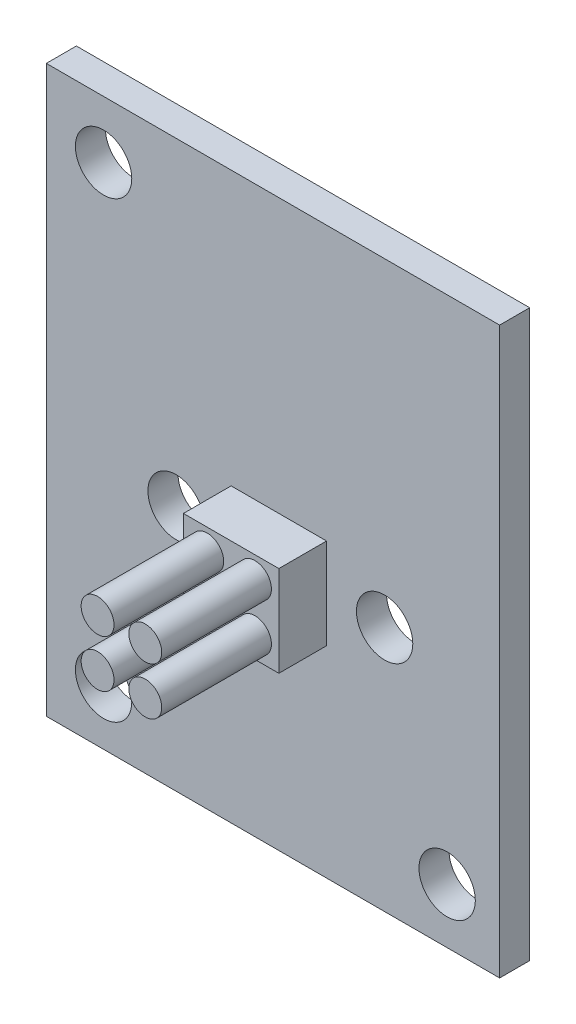
ISO-10303-21;
HEADER;
FILE_DESCRIPTION(('STEP AP214'),'2;1');
FILE_NAME('part.step','',(''),(''),'','','');
FILE_SCHEMA(('AUTOMOTIVE_DESIGN { 1 0 10303 214 1 1 1 1 }'));
ENDSEC;
DATA;
#1=APPLICATION_CONTEXT('core data for automotive mechanical design processes');
#2=APPLICATION_PROTOCOL_DEFINITION('international standard','automotive_design',2000,#1);
#3=PRODUCT_CONTEXT('',#1,'mechanical');
#4=PRODUCT('Part','Part','',(#3));
#5=PRODUCT_RELATED_PRODUCT_CATEGORY('part','',(#4));
#6=PRODUCT_DEFINITION_FORMATION('','',#4);
#7=PRODUCT_DEFINITION_CONTEXT('part definition',#1,'design');
#8=PRODUCT_DEFINITION('design','',#6,#7);
#9=PRODUCT_DEFINITION_SHAPE('','',#8);
#10=(LENGTH_UNIT() NAMED_UNIT(*) SI_UNIT(.MILLI.,.METRE.));
#11=(NAMED_UNIT(*) PLANE_ANGLE_UNIT() SI_UNIT($,.RADIAN.));
#12=(NAMED_UNIT(*) SI_UNIT($,.STERADIAN.) SOLID_ANGLE_UNIT());
#13=UNCERTAINTY_MEASURE_WITH_UNIT(LENGTH_MEASURE(1.E-05),#10,'distance_accuracy_value','');
#14=(GEOMETRIC_REPRESENTATION_CONTEXT(3) GLOBAL_UNCERTAINTY_ASSIGNED_CONTEXT((#13)) GLOBAL_UNIT_ASSIGNED_CONTEXT((#10,
#11,#12)) REPRESENTATION_CONTEXT('',''));
#15=CARTESIAN_POINT('',(0.,0.,0.));
#16=DIRECTION('',(0.,0.,1.));
#17=DIRECTION('',(1.,0.,0.));
#18=AXIS2_PLACEMENT_3D('',#15,#16,#17);
#19=CARTESIAN_POINT('',(0.,0.,2.54));
#20=DIRECTION('',(0.,0.,1.));
#21=DIRECTION('',(1.,0.,0.));
#22=AXIS2_PLACEMENT_3D('',#19,#20,#21);
#23=PLANE('',#22);
#24=CARTESIAN_POINT('',(11.107928,11.854942,2.54));
#25=DIRECTION('',(0.,0.,1.));
#26=DIRECTION('',(1.,0.,0.));
#27=AXIS2_PLACEMENT_3D('',#24,#25,#26);
#28=CIRCLE('',#27,0.875);
#29=CARTESIAN_POINT('',(11.982928,11.854942,2.54));
#30=VERTEX_POINT('',#29);
#31=EDGE_CURVE('E235',#30,#30,#28,.F.);
#32=ORIENTED_EDGE('',*,*,#31,.T.);
#33=EDGE_LOOP('',(#32));
#34=FACE_BOUND('',#33,.T.);
#35=CARTESIAN_POINT('',(13.647928,14.394942,2.54));
#36=DIRECTION('',(0.,0.,1.));
#37=DIRECTION('',(1.,0.,0.));
#38=AXIS2_PLACEMENT_3D('',#35,#36,#37);
#39=CIRCLE('',#38,0.875);
#40=CARTESIAN_POINT('',(14.522928,14.394942,2.54));
#41=VERTEX_POINT('',#40);
#42=EDGE_CURVE('E143',#41,#41,#39,.F.);
#43=ORIENTED_EDGE('',*,*,#42,.T.);
#44=EDGE_LOOP('',(#43));
#45=FACE_BOUND('',#44,.T.);
#46=DIRECTION('',(0.,1.,0.));
#47=VECTOR('',#46,1.);
#48=CARTESIAN_POINT('',(9.837928,0.,2.54));
#49=LINE('',#48,#47);
#50=CARTESIAN_POINT('',(9.837928,10.709942,2.54));
#51=VERTEX_POINT('',#50);
#52=CARTESIAN_POINT('',(9.837928,15.539942,2.54));
#53=VERTEX_POINT('',#52);
#54=EDGE_CURVE('E114',#51,#53,#49,.T.);
#55=ORIENTED_EDGE('',*,*,#54,.F.);
#56=DIRECTION('',(-1.,0.,0.));
#57=VECTOR('',#56,1.);
#58=CARTESIAN_POINT('',(0.,10.709942,2.54));
#59=LINE('',#58,#57);
#60=CARTESIAN_POINT('',(14.917928,10.709942,2.54));
#61=VERTEX_POINT('',#60);
#62=EDGE_CURVE('E127',#61,#51,#59,.T.);
#63=ORIENTED_EDGE('',*,*,#62,.F.);
#64=DIRECTION('',(0.,1.,0.));
#65=VECTOR('',#64,1.);
#66=CARTESIAN_POINT('',(14.917928,0.,2.54));
#67=LINE('',#66,#65);
#68=CARTESIAN_POINT('',(14.917928,15.539942,2.54));
#69=VERTEX_POINT('',#68);
#70=EDGE_CURVE('E134',#61,#69,#67,.T.);
#71=ORIENTED_EDGE('',*,*,#70,.T.);
#72=DIRECTION('',(-1.,0.,0.));
#73=VECTOR('',#72,1.);
#74=CARTESIAN_POINT('',(0.,15.539942,2.54));
#75=LINE('',#74,#73);
#76=EDGE_CURVE('E128',#69,#53,#75,.T.);
#77=ORIENTED_EDGE('',*,*,#76,.T.);
#78=EDGE_LOOP('',(#55,#63,#71,#77));
#79=FACE_BOUND('',#78,.T.);
#80=CARTESIAN_POINT('',(11.107928,14.394942,2.54));
#81=DIRECTION('',(0.,0.,1.));
#82=DIRECTION('',(1.,0.,0.));
#83=AXIS2_PLACEMENT_3D('',#80,#81,#82);
#84=CIRCLE('',#83,0.875);
#85=CARTESIAN_POINT('',(11.982928,14.394942,2.54));
#86=VERTEX_POINT('',#85);
#87=EDGE_CURVE('E232',#86,#86,#84,.F.);
#88=ORIENTED_EDGE('',*,*,#87,.T.);
#89=EDGE_LOOP('',(#88));
#90=FACE_BOUND('',#89,.T.);
#91=CARTESIAN_POINT('',(13.647928,11.854942,2.54));
#92=DIRECTION('',(0.,0.,1.));
#93=DIRECTION('',(1.,0.,0.));
#94=AXIS2_PLACEMENT_3D('',#91,#92,#93);
#95=CIRCLE('',#94,0.875);
#96=CARTESIAN_POINT('',(14.522928,11.854942,2.54));
#97=VERTEX_POINT('',#96);
#98=EDGE_CURVE('E39',#97,#97,#95,.F.);
#99=ORIENTED_EDGE('',*,*,#98,.T.);
#100=EDGE_LOOP('',(#99));
#101=FACE_BOUND('',#100,.T.);
#102=ADVANCED_FACE('F35',(#34,#45,#79,#90,#101),#23,.T.);
#103=CARTESIAN_POINT('',(0.,0.,-1.6));
#104=DIRECTION('',(0.,-1.,0.));
#105=DIRECTION('',(0.,0.,-1.));
#106=AXIS2_PLACEMENT_3D('',#103,#104,#105);
#107=PLANE('',#106);
#108=DIRECTION('',(1.,0.,0.));
#109=VECTOR('',#108,1.);
#110=CARTESIAN_POINT('',(0.,0.,0.));
#111=LINE('',#110,#109);
#112=CARTESIAN_POINT('',(0.,0.,0.));
#113=VERTEX_POINT('',#112);
#114=CARTESIAN_POINT('',(24.13,0.,0.));
#115=VERTEX_POINT('',#114);
#116=EDGE_CURVE('E214',#113,#115,#111,.T.);
#117=ORIENTED_EDGE('',*,*,#116,.F.);
#118=DIRECTION('',(0.,0.,1.));
#119=VECTOR('',#118,1.);
#120=CARTESIAN_POINT('',(0.,0.,-1.6));
#121=LINE('',#120,#119);
#122=CARTESIAN_POINT('',(0.,0.,-1.6));
#123=VERTEX_POINT('',#122);
#124=EDGE_CURVE('E11',#123,#113,#121,.T.);
#125=ORIENTED_EDGE('',*,*,#124,.F.);
#126=DIRECTION('',(1.,0.,0.));
#127=VECTOR('',#126,1.);
#128=CARTESIAN_POINT('',(0.,0.,-1.6));
#129=LINE('',#128,#127);
#130=CARTESIAN_POINT('',(24.13,0.,-1.6));
#131=VERTEX_POINT('',#130);
#132=EDGE_CURVE('E191',#123,#131,#129,.T.);
#133=ORIENTED_EDGE('',*,*,#132,.T.);
#134=DIRECTION('',(0.,0.,1.));
#135=VECTOR('',#134,1.);
#136=CARTESIAN_POINT('',(24.13,0.,-1.6));
#137=LINE('',#136,#135);
#138=EDGE_CURVE('E85',#131,#115,#137,.T.);
#139=ORIENTED_EDGE('',*,*,#138,.T.);
#140=EDGE_LOOP('',(#117,#125,#133,#139));
#141=FACE_BOUND('',#140,.T.);
#142=ADVANCED_FACE('F272',(#141),#107,.T.);
#143=CARTESIAN_POINT('',(0.,0.,-1.6));
#144=DIRECTION('',(1.,0.,0.));
#145=DIRECTION('',(0.,0.,-1.));
#146=AXIS2_PLACEMENT_3D('',#143,#144,#145);
#147=PLANE('',#146);
#148=DIRECTION('',(0.,1.,0.));
#149=VECTOR('',#148,1.);
#150=CARTESIAN_POINT('',(0.,0.,0.));
#151=LINE('',#150,#149);
#152=CARTESIAN_POINT('',(0.,30.099,0.));
#153=VERTEX_POINT('',#152);
#154=EDGE_CURVE('E167',#113,#153,#151,.T.);
#155=ORIENTED_EDGE('',*,*,#154,.T.);
#156=DIRECTION('',(0.,0.,1.));
#157=VECTOR('',#156,1.);
#158=CARTESIAN_POINT('',(0.,30.099,-1.6));
#159=LINE('',#158,#157);
#160=CARTESIAN_POINT('',(0.,30.099,-1.6));
#161=VERTEX_POINT('',#160);
#162=EDGE_CURVE('E44',#161,#153,#159,.T.);
#163=ORIENTED_EDGE('',*,*,#162,.F.);
#164=DIRECTION('',(0.,1.,0.));
#165=VECTOR('',#164,1.);
#166=CARTESIAN_POINT('',(0.,0.,-1.6));
#167=LINE('',#166,#165);
#168=EDGE_CURVE('E197',#123,#161,#167,.T.);
#169=ORIENTED_EDGE('',*,*,#168,.F.);
#170=ORIENTED_EDGE('',*,*,#124,.T.);
#171=EDGE_LOOP('',(#155,#163,#169,#170));
#172=FACE_BOUND('',#171,.T.);
#173=ADVANCED_FACE('F276',(#172),#147,.F.);
#174=CARTESIAN_POINT('',(0.,30.099,-1.6));
#175=DIRECTION('',(0.,-1.,0.));
#176=DIRECTION('',(0.,0.,-1.));
#177=AXIS2_PLACEMENT_3D('',#174,#175,#176);
#178=PLANE('',#177);
#179=DIRECTION('',(1.,0.,0.));
#180=VECTOR('',#179,1.);
#181=CARTESIAN_POINT('',(0.,30.099,0.));
#182=LINE('',#181,#180);
#183=CARTESIAN_POINT('',(24.13,30.099,0.));
#184=VERTEX_POINT('',#183);
#185=EDGE_CURVE('E220',#153,#184,#182,.T.);
#186=ORIENTED_EDGE('',*,*,#185,.T.);
#187=DIRECTION('',(0.,0.,1.));
#188=VECTOR('',#187,1.);
#189=CARTESIAN_POINT('',(24.13,30.099,-1.6));
#190=LINE('',#189,#188);
#191=CARTESIAN_POINT('',(24.13,30.099,-1.6));
#192=VERTEX_POINT('',#191);
#193=EDGE_CURVE('E226',#192,#184,#190,.T.);
#194=ORIENTED_EDGE('',*,*,#193,.F.);
#195=DIRECTION('',(1.,0.,0.));
#196=VECTOR('',#195,1.);
#197=CARTESIAN_POINT('',(0.,30.099,-1.6));
#198=LINE('',#197,#196);
#199=EDGE_CURVE('E195',#161,#192,#198,.T.);
#200=ORIENTED_EDGE('',*,*,#199,.F.);
#201=ORIENTED_EDGE('',*,*,#162,.T.);
#202=EDGE_LOOP('',(#186,#194,#200,#201));
#203=FACE_BOUND('',#202,.T.);
#204=ADVANCED_FACE('F302',(#203),#178,.F.);
#205=CARTESIAN_POINT('',(3.048,2.921,-1.6));
#206=DIRECTION('',(0.,0.,1.));
#207=DIRECTION('',(1.,0.,0.));
#208=AXIS2_PLACEMENT_3D('',#205,#206,#207);
#209=CYLINDRICAL_SURFACE('',#208,1.5);
#210=CARTESIAN_POINT('',(3.048,2.921,-1.6));
#211=DIRECTION('',(0.,0.,1.));
#212=DIRECTION('',(1.,0.,0.));
#213=AXIS2_PLACEMENT_3D('',#210,#211,#212);
#214=CIRCLE('',#213,1.5);
#215=CARTESIAN_POINT('',(4.548,2.921,-1.6));
#216=VERTEX_POINT('',#215);
#217=EDGE_CURVE('E188',#216,#216,#214,.T.);
#218=ORIENTED_EDGE('',*,*,#217,.F.);
#219=EDGE_LOOP('',(#218));
#220=FACE_BOUND('',#219,.T.);
#221=CARTESIAN_POINT('',(3.048,2.921,0.));
#222=DIRECTION('',(0.,0.,1.));
#223=DIRECTION('',(1.,0.,0.));
#224=AXIS2_PLACEMENT_3D('',#221,#222,#223);
#225=CIRCLE('',#224,1.5);
#226=CARTESIAN_POINT('',(4.548,2.921,0.));
#227=VERTEX_POINT('',#226);
#228=EDGE_CURVE('E211',#227,#227,#225,.T.);
#229=ORIENTED_EDGE('',*,*,#228,.T.);
#230=EDGE_LOOP('',(#229));
#231=FACE_BOUND('',#230,.T.);
#232=ADVANCED_FACE('F305',(#220,#231),#209,.F.);
#233=CARTESIAN_POINT('',(21.336,2.921,-1.6));
#234=DIRECTION('',(0.,0.,1.));
#235=DIRECTION('',(1.,0.,0.));
#236=AXIS2_PLACEMENT_3D('',#233,#234,#235);
#237=CYLINDRICAL_SURFACE('',#236,1.5);
#238=CARTESIAN_POINT('',(21.336,2.921,-1.6));
#239=DIRECTION('',(0.,0.,1.));
#240=DIRECTION('',(1.,0.,0.));
#241=AXIS2_PLACEMENT_3D('',#238,#239,#240);
#242=CIRCLE('',#241,1.5);
#243=CARTESIAN_POINT('',(22.836,2.921,-1.6));
#244=VERTEX_POINT('',#243);
#245=EDGE_CURVE('E185',#244,#244,#242,.T.);
#246=ORIENTED_EDGE('',*,*,#245,.F.);
#247=EDGE_LOOP('',(#246));
#248=FACE_BOUND('',#247,.T.);
#249=CARTESIAN_POINT('',(21.336,2.921,0.));
#250=DIRECTION('',(0.,0.,1.));
#251=DIRECTION('',(1.,0.,0.));
#252=AXIS2_PLACEMENT_3D('',#249,#250,#251);
#253=CIRCLE('',#252,1.5);
#254=CARTESIAN_POINT('',(22.836,2.921,0.));
#255=VERTEX_POINT('',#254);
#256=EDGE_CURVE('E208',#255,#255,#253,.T.);
#257=ORIENTED_EDGE('',*,*,#256,.T.);
#258=EDGE_LOOP('',(#257));
#259=FACE_BOUND('',#258,.T.);
#260=ADVANCED_FACE('F311',(#248,#259),#237,.F.);
#261=CARTESIAN_POINT('',(3.048,27.051,-1.6));
#262=DIRECTION('',(0.,0.,1.));
#263=DIRECTION('',(1.,0.,0.));
#264=AXIS2_PLACEMENT_3D('',#261,#262,#263);
#265=CYLINDRICAL_SURFACE('',#264,1.5);
#266=CARTESIAN_POINT('',(3.048,27.051,-1.6));
#267=DIRECTION('',(0.,0.,1.));
#268=DIRECTION('',(1.,0.,0.));
#269=AXIS2_PLACEMENT_3D('',#266,#267,#268);
#270=CIRCLE('',#269,1.5);
#271=CARTESIAN_POINT('',(4.548,27.051,-1.6));
#272=VERTEX_POINT('',#271);
#273=EDGE_CURVE('E182',#272,#272,#270,.T.);
#274=ORIENTED_EDGE('',*,*,#273,.F.);
#275=EDGE_LOOP('',(#274));
#276=FACE_BOUND('',#275,.T.);
#277=CARTESIAN_POINT('',(3.048,27.051,0.));
#278=DIRECTION('',(0.,0.,1.));
#279=DIRECTION('',(1.,0.,0.));
#280=AXIS2_PLACEMENT_3D('',#277,#278,#279);
#281=CIRCLE('',#280,1.5);
#282=CARTESIAN_POINT('',(4.548,27.051,0.));
#283=VERTEX_POINT('',#282);
#284=EDGE_CURVE('E205',#283,#283,#281,.T.);
#285=ORIENTED_EDGE('',*,*,#284,.T.);
#286=EDGE_LOOP('',(#285));
#287=FACE_BOUND('',#286,.T.);
#288=ADVANCED_FACE('F315',(#276,#287),#265,.F.);
#289=CARTESIAN_POINT('',(6.908038,13.09497,-1.6));
#290=DIRECTION('',(0.,0.,1.));
#291=DIRECTION('',(1.,0.,0.));
#292=AXIS2_PLACEMENT_3D('',#289,#290,#291);
#293=CYLINDRICAL_SURFACE('',#292,1.5);
#294=CARTESIAN_POINT('',(6.908038,13.09497,-1.6));
#295=DIRECTION('',(0.,0.,1.));
#296=DIRECTION('',(1.,0.,0.));
#297=AXIS2_PLACEMENT_3D('',#294,#295,#296);
#298=CIRCLE('',#297,1.5);
#299=CARTESIAN_POINT('',(8.408038,13.09497,-1.6));
#300=VERTEX_POINT('',#299);
#301=EDGE_CURVE('E179',#300,#300,#298,.T.);
#302=ORIENTED_EDGE('',*,*,#301,.F.);
#303=EDGE_LOOP('',(#302));
#304=FACE_BOUND('',#303,.T.);
#305=CARTESIAN_POINT('',(6.908038,13.09497,0.));
#306=DIRECTION('',(0.,0.,1.));
#307=DIRECTION('',(1.,0.,0.));
#308=AXIS2_PLACEMENT_3D('',#305,#306,#307);
#309=CIRCLE('',#308,1.5);
#310=CARTESIAN_POINT('',(8.408038,13.09497,0.));
#311=VERTEX_POINT('',#310);
#312=EDGE_CURVE('E202',#311,#311,#309,.T.);
#313=ORIENTED_EDGE('',*,*,#312,.T.);
#314=EDGE_LOOP('',(#313));
#315=FACE_BOUND('',#314,.T.);
#316=ADVANCED_FACE('F319',(#304,#315),#293,.F.);
#317=CARTESIAN_POINT('',(18.008092,13.09497,-1.6));
#318=DIRECTION('',(0.,0.,1.));
#319=DIRECTION('',(1.,0.,0.));
#320=AXIS2_PLACEMENT_3D('',#317,#318,#319);
#321=CYLINDRICAL_SURFACE('',#320,1.5);
#322=CARTESIAN_POINT('',(18.008092,13.09497,-1.6));
#323=DIRECTION('',(0.,0.,1.));
#324=DIRECTION('',(1.,0.,0.));
#325=AXIS2_PLACEMENT_3D('',#322,#323,#324);
#326=CIRCLE('',#325,1.5);
#327=CARTESIAN_POINT('',(19.508092,13.09497,-1.6));
#328=VERTEX_POINT('',#327);
#329=EDGE_CURVE('E176',#328,#328,#326,.T.);
#330=ORIENTED_EDGE('',*,*,#329,.F.);
#331=EDGE_LOOP('',(#330));
#332=FACE_BOUND('',#331,.T.);
#333=CARTESIAN_POINT('',(18.008092,13.09497,0.));
#334=DIRECTION('',(0.,0.,1.));
#335=DIRECTION('',(1.,0.,0.));
#336=AXIS2_PLACEMENT_3D('',#333,#334,#335);
#337=CIRCLE('',#336,1.5);
#338=CARTESIAN_POINT('',(19.508092,13.09497,0.));
#339=VERTEX_POINT('',#338);
#340=EDGE_CURVE('E162',#339,#339,#337,.T.);
#341=ORIENTED_EDGE('',*,*,#340,.T.);
#342=EDGE_LOOP('',(#341));
#343=FACE_BOUND('',#342,.T.);
#344=ADVANCED_FACE('F323',(#332,#343),#321,.F.);
#345=CARTESIAN_POINT('',(11.107928,14.394942,-1.6));
#346=DIRECTION('',(0.,0.,1.));
#347=DIRECTION('',(1.,0.,0.));
#348=AXIS2_PLACEMENT_3D('',#345,#346,#347);
#349=CYLINDRICAL_SURFACE('',#348,0.875);
#350=CARTESIAN_POINT('',(11.107928,14.394942,-1.6));
#351=DIRECTION('',(0.,0.,1.));
#352=DIRECTION('',(1.,0.,0.));
#353=AXIS2_PLACEMENT_3D('',#350,#351,#352);
#354=CIRCLE('',#353,0.875);
#355=CARTESIAN_POINT('',(11.982928,14.394942,-1.6));
#356=VERTEX_POINT('',#355);
#357=EDGE_CURVE('E173',#356,#356,#354,.T.);
#358=ORIENTED_EDGE('',*,*,#357,.F.);
#359=EDGE_LOOP('',(#358));
#360=FACE_BOUND('',#359,.T.);
#361=CARTESIAN_POINT('',(11.107928,14.394942,0.));
#362=DIRECTION('',(0.,0.,1.));
#363=DIRECTION('',(1.,0.,0.));
#364=AXIS2_PLACEMENT_3D('',#361,#362,#363);
#365=CIRCLE('',#364,0.875);
#366=CARTESIAN_POINT('',(11.982928,14.394942,0.));
#367=VERTEX_POINT('',#366);
#368=EDGE_CURVE('E159',#367,#367,#365,.F.);
#369=ORIENTED_EDGE('',*,*,#368,.F.);
#370=EDGE_LOOP('',(#369));
#371=FACE_BOUND('',#370,.T.);
#372=ADVANCED_FACE('F327',(#360,#371),#349,.F.);
#373=CARTESIAN_POINT('',(13.647928,14.394942,-1.6));
#374=DIRECTION('',(0.,0.,1.));
#375=DIRECTION('',(1.,0.,0.));
#376=AXIS2_PLACEMENT_3D('',#373,#374,#375);
#377=CYLINDRICAL_SURFACE('',#376,0.875);
#378=CARTESIAN_POINT('',(13.647928,14.394942,-1.6));
#379=DIRECTION('',(0.,0.,1.));
#380=DIRECTION('',(1.,0.,0.));
#381=AXIS2_PLACEMENT_3D('',#378,#379,#380);
#382=CIRCLE('',#381,0.875);
#383=CARTESIAN_POINT('',(14.522928,14.394942,-1.6));
#384=VERTEX_POINT('',#383);
#385=EDGE_CURVE('E170',#384,#384,#382,.T.);
#386=ORIENTED_EDGE('',*,*,#385,.F.);
#387=EDGE_LOOP('',(#386));
#388=FACE_BOUND('',#387,.T.);
#389=CARTESIAN_POINT('',(13.647928,14.394942,0.));
#390=DIRECTION('',(0.,0.,1.));
#391=DIRECTION('',(1.,0.,0.));
#392=AXIS2_PLACEMENT_3D('',#389,#390,#391);
#393=CIRCLE('',#392,0.875);
#394=CARTESIAN_POINT('',(14.522928,14.394942,0.));
#395=VERTEX_POINT('',#394);
#396=EDGE_CURVE('E156',#395,#395,#393,.F.);
#397=ORIENTED_EDGE('',*,*,#396,.F.);
#398=EDGE_LOOP('',(#397));
#399=FACE_BOUND('',#398,.T.);
#400=ADVANCED_FACE('F331',(#388,#399),#377,.F.);
#401=CARTESIAN_POINT('',(11.107928,11.854942,-1.6));
#402=DIRECTION('',(0.,0.,1.));
#403=DIRECTION('',(1.,0.,0.));
#404=AXIS2_PLACEMENT_3D('',#401,#402,#403);
#405=CYLINDRICAL_SURFACE('',#404,0.875);
#406=CARTESIAN_POINT('',(11.107928,11.854942,-1.6));
#407=DIRECTION('',(0.,0.,1.));
#408=DIRECTION('',(1.,0.,0.));
#409=AXIS2_PLACEMENT_3D('',#406,#407,#408);
#410=CIRCLE('',#409,0.875);
#411=CARTESIAN_POINT('',(11.982928,11.854942,-1.6));
#412=VERTEX_POINT('',#411);
#413=EDGE_CURVE('E166',#412,#412,#410,.T.);
#414=ORIENTED_EDGE('',*,*,#413,.F.);
#415=EDGE_LOOP('',(#414));
#416=FACE_BOUND('',#415,.T.);
#417=CARTESIAN_POINT('',(11.107928,11.854942,0.));
#418=DIRECTION('',(0.,0.,1.));
#419=DIRECTION('',(1.,0.,0.));
#420=AXIS2_PLACEMENT_3D('',#417,#418,#419);
#421=CIRCLE('',#420,0.875);
#422=CARTESIAN_POINT('',(11.982928,11.854942,0.));
#423=VERTEX_POINT('',#422);
#424=EDGE_CURVE('E153',#423,#423,#421,.F.);
#425=ORIENTED_EDGE('',*,*,#424,.F.);
#426=EDGE_LOOP('',(#425));
#427=FACE_BOUND('',#426,.T.);
#428=ADVANCED_FACE('F334',(#416,#427),#405,.F.);
#429=CARTESIAN_POINT('',(13.647928,11.854942,-1.6));
#430=DIRECTION('',(0.,0.,1.));
#431=DIRECTION('',(1.,0.,0.));
#432=AXIS2_PLACEMENT_3D('',#429,#430,#431);
#433=CYLINDRICAL_SURFACE('',#432,0.875);
#434=CARTESIAN_POINT('',(13.647928,11.854942,-1.6));
#435=DIRECTION('',(0.,0.,1.));
#436=DIRECTION('',(1.,0.,0.));
#437=AXIS2_PLACEMENT_3D('',#434,#435,#436);
#438=CIRCLE('',#437,0.875);
#439=CARTESIAN_POINT('',(14.522928,11.854942,-1.6));
#440=VERTEX_POINT('',#439);
#441=EDGE_CURVE('E163',#440,#440,#438,.T.);
#442=ORIENTED_EDGE('',*,*,#441,.F.);
#443=EDGE_LOOP('',(#442));
#444=FACE_BOUND('',#443,.T.);
#445=CARTESIAN_POINT('',(13.647928,11.854942,0.));
#446=DIRECTION('',(0.,0.,1.));
#447=DIRECTION('',(1.,0.,0.));
#448=AXIS2_PLACEMENT_3D('',#445,#446,#447);
#449=CIRCLE('',#448,0.875);
#450=CARTESIAN_POINT('',(14.522928,11.854942,0.));
#451=VERTEX_POINT('',#450);
#452=EDGE_CURVE('E121',#451,#451,#449,.F.);
#453=ORIENTED_EDGE('',*,*,#452,.F.);
#454=EDGE_LOOP('',(#453));
#455=FACE_BOUND('',#454,.T.);
#456=ADVANCED_FACE('F37',(#444,#455),#433,.F.);
#457=CARTESIAN_POINT('',(24.13,0.,-1.6));
#458=DIRECTION('',(1.,0.,0.));
#459=DIRECTION('',(0.,0.,-1.));
#460=AXIS2_PLACEMENT_3D('',#457,#458,#459);
#461=PLANE('',#460);
#462=DIRECTION('',(0.,1.,0.));
#463=VECTOR('',#462,1.);
#464=CARTESIAN_POINT('',(24.13,0.,0.));
#465=LINE('',#464,#463);
#466=EDGE_CURVE('E217',#115,#184,#465,.T.);
#467=ORIENTED_EDGE('',*,*,#466,.F.);
#468=ORIENTED_EDGE('',*,*,#138,.F.);
#469=DIRECTION('',(0.,1.,0.));
#470=VECTOR('',#469,1.);
#471=CARTESIAN_POINT('',(24.13,0.,-1.6));
#472=LINE('',#471,#470);
#473=EDGE_CURVE('E193',#131,#192,#472,.T.);
#474=ORIENTED_EDGE('',*,*,#473,.T.);
#475=ORIENTED_EDGE('',*,*,#193,.T.);
#476=EDGE_LOOP('',(#467,#468,#474,#475));
#477=FACE_BOUND('',#476,.T.);
#478=ADVANCED_FACE('F295',(#477),#461,.T.);
#479=CARTESIAN_POINT('',(0.,0.,-1.6));
#480=DIRECTION('',(0.,0.,1.));
#481=DIRECTION('',(1.,0.,0.));
#482=AXIS2_PLACEMENT_3D('',#479,#480,#481);
#483=PLANE('',#482);
#484=ORIENTED_EDGE('',*,*,#441,.T.);
#485=EDGE_LOOP('',(#484));
#486=FACE_BOUND('',#485,.T.);
#487=ORIENTED_EDGE('',*,*,#413,.T.);
#488=EDGE_LOOP('',(#487));
#489=FACE_BOUND('',#488,.T.);
#490=ORIENTED_EDGE('',*,*,#385,.T.);
#491=EDGE_LOOP('',(#490));
#492=FACE_BOUND('',#491,.T.);
#493=ORIENTED_EDGE('',*,*,#357,.T.);
#494=EDGE_LOOP('',(#493));
#495=FACE_BOUND('',#494,.T.);
#496=ORIENTED_EDGE('',*,*,#329,.T.);
#497=EDGE_LOOP('',(#496));
#498=FACE_BOUND('',#497,.T.);
#499=ORIENTED_EDGE('',*,*,#301,.T.);
#500=EDGE_LOOP('',(#499));
#501=FACE_BOUND('',#500,.T.);
#502=ORIENTED_EDGE('',*,*,#273,.T.);
#503=EDGE_LOOP('',(#502));
#504=FACE_BOUND('',#503,.T.);
#505=ORIENTED_EDGE('',*,*,#245,.T.);
#506=EDGE_LOOP('',(#505));
#507=FACE_BOUND('',#506,.T.);
#508=ORIENTED_EDGE('',*,*,#217,.T.);
#509=EDGE_LOOP('',(#508));
#510=FACE_BOUND('',#509,.T.);
#511=ORIENTED_EDGE('',*,*,#132,.F.);
#512=ORIENTED_EDGE('',*,*,#168,.T.);
#513=ORIENTED_EDGE('',*,*,#199,.T.);
#514=ORIENTED_EDGE('',*,*,#473,.F.);
#515=EDGE_LOOP('',(#511,#512,#513,#514));
#516=FACE_BOUND('',#515,.T.);
#517=ADVANCED_FACE('F292',(#486,#489,#492,#495,#498,#501,#504,#507,#510,#516),#483,.F.);
#518=CARTESIAN_POINT('',(0.,0.,0.));
#519=DIRECTION('',(0.,0.,1.));
#520=DIRECTION('',(1.,0.,0.));
#521=AXIS2_PLACEMENT_3D('',#518,#519,#520);
#522=PLANE('',#521);
#523=DIRECTION('',(0.,1.,0.));
#524=VECTOR('',#523,1.);
#525=CARTESIAN_POINT('',(9.837928,0.,0.));
#526=LINE('',#525,#524);
#527=CARTESIAN_POINT('',(9.837928,10.709942,0.));
#528=VERTEX_POINT('',#527);
#529=CARTESIAN_POINT('',(9.837928,15.539942,0.));
#530=VERTEX_POINT('',#529);
#531=EDGE_CURVE('E116',#528,#530,#526,.T.);
#532=ORIENTED_EDGE('',*,*,#531,.T.);
#533=DIRECTION('',(-1.,0.,0.));
#534=VECTOR('',#533,1.);
#535=CARTESIAN_POINT('',(0.,15.539942,0.));
#536=LINE('',#535,#534);
#537=CARTESIAN_POINT('',(14.917928,15.539942,0.));
#538=VERTEX_POINT('',#537);
#539=EDGE_CURVE('E130',#538,#530,#536,.T.);
#540=ORIENTED_EDGE('',*,*,#539,.F.);
#541=DIRECTION('',(0.,1.,0.));
#542=VECTOR('',#541,1.);
#543=CARTESIAN_POINT('',(14.917928,0.,0.));
#544=LINE('',#543,#542);
#545=CARTESIAN_POINT('',(14.917928,10.709942,0.));
#546=VERTEX_POINT('',#545);
#547=EDGE_CURVE('E145',#546,#538,#544,.T.);
#548=ORIENTED_EDGE('',*,*,#547,.F.);
#549=DIRECTION('',(-1.,0.,0.));
#550=VECTOR('',#549,1.);
#551=CARTESIAN_POINT('',(0.,10.709942,0.));
#552=LINE('',#551,#550);
#553=EDGE_CURVE('E142',#546,#528,#552,.T.);
#554=ORIENTED_EDGE('',*,*,#553,.T.);
#555=EDGE_LOOP('',(#532,#540,#548,#554));
#556=FACE_BOUND('',#555,.T.);
#557=ORIENTED_EDGE('',*,*,#340,.F.);
#558=EDGE_LOOP('',(#557));
#559=FACE_BOUND('',#558,.T.);
#560=ORIENTED_EDGE('',*,*,#312,.F.);
#561=EDGE_LOOP('',(#560));
#562=FACE_BOUND('',#561,.T.);
#563=ORIENTED_EDGE('',*,*,#284,.F.);
#564=EDGE_LOOP('',(#563));
#565=FACE_BOUND('',#564,.T.);
#566=ORIENTED_EDGE('',*,*,#256,.F.);
#567=EDGE_LOOP('',(#566));
#568=FACE_BOUND('',#567,.T.);
#569=ORIENTED_EDGE('',*,*,#228,.F.);
#570=EDGE_LOOP('',(#569));
#571=FACE_BOUND('',#570,.T.);
#572=ORIENTED_EDGE('',*,*,#116,.T.);
#573=ORIENTED_EDGE('',*,*,#466,.T.);
#574=ORIENTED_EDGE('',*,*,#185,.F.);
#575=ORIENTED_EDGE('',*,*,#154,.F.);
#576=EDGE_LOOP('',(#572,#573,#574,#575));
#577=FACE_BOUND('',#576,.T.);
#578=ADVANCED_FACE('F284',(#556,#559,#562,#565,#568,#571,#577),#522,.T.);
#579=CARTESIAN_POINT('',(0.,15.539942,2.54));
#580=DIRECTION('',(0.,-1.,0.));
#581=DIRECTION('',(1.,0.,0.));
#582=AXIS2_PLACEMENT_3D('',#579,#580,#581);
#583=PLANE('',#582);
#584=ORIENTED_EDGE('',*,*,#539,.T.);
#585=DIRECTION('',(0.,0.,-1.));
#586=VECTOR('',#585,1.);
#587=CARTESIAN_POINT('',(9.837928,15.539942,2.54));
#588=LINE('',#587,#586);
#589=EDGE_CURVE('E140',#53,#530,#588,.T.);
#590=ORIENTED_EDGE('',*,*,#589,.F.);
#591=ORIENTED_EDGE('',*,*,#76,.F.);
#592=DIRECTION('',(0.,0.,-1.));
#593=VECTOR('',#592,1.);
#594=CARTESIAN_POINT('',(14.917928,15.539942,2.54));
#595=LINE('',#594,#593);
#596=EDGE_CURVE('E52',#69,#538,#595,.T.);
#597=ORIENTED_EDGE('',*,*,#596,.T.);
#598=EDGE_LOOP('',(#584,#590,#591,#597));
#599=FACE_BOUND('',#598,.T.);
#600=ADVANCED_FACE('F280',(#599),#583,.F.);
#601=CARTESIAN_POINT('',(14.917928,0.,2.54));
#602=DIRECTION('',(-1.,0.,0.));
#603=DIRECTION('',(0.,-1.,0.));
#604=AXIS2_PLACEMENT_3D('',#601,#602,#603);
#605=PLANE('',#604);
#606=ORIENTED_EDGE('',*,*,#547,.T.);
#607=ORIENTED_EDGE('',*,*,#596,.F.);
#608=ORIENTED_EDGE('',*,*,#70,.F.);
#609=DIRECTION('',(0.,0.,-1.));
#610=VECTOR('',#609,1.);
#611=CARTESIAN_POINT('',(14.917928,10.709942,2.54));
#612=LINE('',#611,#610);
#613=EDGE_CURVE('E122',#61,#546,#612,.T.);
#614=ORIENTED_EDGE('',*,*,#613,.T.);
#615=EDGE_LOOP('',(#606,#607,#608,#614));
#616=FACE_BOUND('',#615,.T.);
#617=ADVANCED_FACE('F283',(#616),#605,.F.);
#618=CARTESIAN_POINT('',(0.,10.709942,2.54));
#619=DIRECTION('',(0.,-1.,0.));
#620=DIRECTION('',(1.,0.,0.));
#621=AXIS2_PLACEMENT_3D('',#618,#619,#620);
#622=PLANE('',#621);
#623=ORIENTED_EDGE('',*,*,#553,.F.);
#624=ORIENTED_EDGE('',*,*,#613,.F.);
#625=ORIENTED_EDGE('',*,*,#62,.T.);
#626=DIRECTION('',(0.,0.,-1.));
#627=VECTOR('',#626,1.);
#628=CARTESIAN_POINT('',(9.837928,10.709942,2.54));
#629=LINE('',#628,#627);
#630=EDGE_CURVE('E111',#51,#528,#629,.T.);
#631=ORIENTED_EDGE('',*,*,#630,.T.);
#632=EDGE_LOOP('',(#623,#624,#625,#631));
#633=FACE_BOUND('',#632,.T.);
#634=ADVANCED_FACE('F132',(#633),#622,.T.);
#635=CARTESIAN_POINT('',(9.837928,0.,2.54));
#636=DIRECTION('',(-1.,0.,0.));
#637=DIRECTION('',(0.,-1.,0.));
#638=AXIS2_PLACEMENT_3D('',#635,#636,#637);
#639=PLANE('',#638);
#640=ORIENTED_EDGE('',*,*,#531,.F.);
#641=ORIENTED_EDGE('',*,*,#630,.F.);
#642=ORIENTED_EDGE('',*,*,#54,.T.);
#643=ORIENTED_EDGE('',*,*,#589,.T.);
#644=EDGE_LOOP('',(#640,#641,#642,#643));
#645=FACE_BOUND('',#644,.T.);
#646=ADVANCED_FACE('F113',(#645),#639,.T.);
#647=CARTESIAN_POINT('',(0.,0.,0.));
#648=DIRECTION('',(0.,0.,1.));
#649=DIRECTION('',(1.,0.,0.));
#650=AXIS2_PLACEMENT_3D('',#647,#648,#649);
#651=PLANE('',#650);
#652=ORIENTED_EDGE('',*,*,#452,.T.);
#653=EDGE_LOOP('',(#652));
#654=FACE_BOUND('',#653,.T.);
#655=ADVANCED_FACE('F268',(#654),#651,.F.);
#656=ORIENTED_EDGE('',*,*,#424,.T.);
#657=EDGE_LOOP('',(#656));
#658=FACE_BOUND('',#657,.T.);
#659=ADVANCED_FACE('F346',(#658),#651,.F.);
#660=ORIENTED_EDGE('',*,*,#396,.T.);
#661=EDGE_LOOP('',(#660));
#662=FACE_BOUND('',#661,.T.);
#663=ADVANCED_FACE('F265',(#662),#651,.F.);
#664=ORIENTED_EDGE('',*,*,#368,.T.);
#665=EDGE_LOOP('',(#664));
#666=FACE_BOUND('',#665,.T.);
#667=ADVANCED_FACE('F256',(#666),#651,.F.);
#668=CARTESIAN_POINT('',(13.647928,14.394942,8.38));
#669=DIRECTION('',(0.,0.,-1.));
#670=DIRECTION('',(-1.,0.,0.));
#671=AXIS2_PLACEMENT_3D('',#668,#669,#670);
#672=CYLINDRICAL_SURFACE('',#671,0.875);
#673=ORIENTED_EDGE('',*,*,#42,.F.);
#674=EDGE_LOOP('',(#673));
#675=FACE_BOUND('',#674,.T.);
#676=CARTESIAN_POINT('',(13.647928,14.394942,8.38));
#677=DIRECTION('',(0.,0.,1.));
#678=DIRECTION('',(1.,0.,0.));
#679=AXIS2_PLACEMENT_3D('',#676,#677,#678);
#680=CIRCLE('',#679,0.875);
#681=CARTESIAN_POINT('',(14.522928,14.394942,8.38));
#682=VERTEX_POINT('',#681);
#683=EDGE_CURVE('E231',#682,#682,#680,.T.);
#684=ORIENTED_EDGE('',*,*,#683,.F.);
#685=EDGE_LOOP('',(#684));
#686=FACE_BOUND('',#685,.T.);
#687=ADVANCED_FACE('F254',(#675,#686),#672,.T.);
#688=CARTESIAN_POINT('',(0.,0.,8.38));
#689=DIRECTION('',(0.,0.,1.));
#690=DIRECTION('',(1.,0.,0.));
#691=AXIS2_PLACEMENT_3D('',#688,#689,#690);
#692=PLANE('',#691);
#693=ORIENTED_EDGE('',*,*,#683,.T.);
#694=EDGE_LOOP('',(#693));
#695=FACE_BOUND('',#694,.T.);
#696=ADVANCED_FACE('F252',(#695),#692,.T.);
#697=CARTESIAN_POINT('',(11.107928,14.394942,8.38));
#698=DIRECTION('',(0.,0.,-1.));
#699=DIRECTION('',(-1.,0.,0.));
#700=AXIS2_PLACEMENT_3D('',#697,#698,#699);
#701=CYLINDRICAL_SURFACE('',#700,0.875);
#702=ORIENTED_EDGE('',*,*,#87,.F.);
#703=EDGE_LOOP('',(#702));
#704=FACE_BOUND('',#703,.T.);
#705=CARTESIAN_POINT('',(11.107928,14.394942,8.38));
#706=DIRECTION('',(0.,0.,1.));
#707=DIRECTION('',(1.,0.,0.));
#708=AXIS2_PLACEMENT_3D('',#705,#706,#707);
#709=CIRCLE('',#708,0.875);
#710=CARTESIAN_POINT('',(11.982928,14.394942,8.38));
#711=VERTEX_POINT('',#710);
#712=EDGE_CURVE('E234',#711,#711,#709,.T.);
#713=ORIENTED_EDGE('',*,*,#712,.F.);
#714=EDGE_LOOP('',(#713));
#715=FACE_BOUND('',#714,.T.);
#716=ADVANCED_FACE('F263',(#704,#715),#701,.T.);
#717=CARTESIAN_POINT('',(0.,0.,8.38));
#718=DIRECTION('',(0.,0.,1.));
#719=DIRECTION('',(1.,0.,0.));
#720=AXIS2_PLACEMENT_3D('',#717,#718,#719);
#721=PLANE('',#720);
#722=ORIENTED_EDGE('',*,*,#712,.T.);
#723=EDGE_LOOP('',(#722));
#724=FACE_BOUND('',#723,.T.);
#725=ADVANCED_FACE('F543',(#724),#721,.T.);
#726=CARTESIAN_POINT('',(11.107928,11.854942,8.38));
#727=DIRECTION('',(0.,0.,-1.));
#728=DIRECTION('',(-1.,0.,0.));
#729=AXIS2_PLACEMENT_3D('',#726,#727,#728);
#730=CYLINDRICAL_SURFACE('',#729,0.875);
#731=ORIENTED_EDGE('',*,*,#31,.F.);
#732=EDGE_LOOP('',(#731));
#733=FACE_BOUND('',#732,.T.);
#734=CARTESIAN_POINT('',(11.107928,11.854942,8.38));
#735=DIRECTION('',(0.,0.,1.));
#736=DIRECTION('',(1.,0.,0.));
#737=AXIS2_PLACEMENT_3D('',#734,#735,#736);
#738=CIRCLE('',#737,0.875);
#739=CARTESIAN_POINT('',(11.982928,11.854942,8.38));
#740=VERTEX_POINT('',#739);
#741=EDGE_CURVE('E237',#740,#740,#738,.T.);
#742=ORIENTED_EDGE('',*,*,#741,.F.);
#743=EDGE_LOOP('',(#742));
#744=FACE_BOUND('',#743,.T.);
#745=ADVANCED_FACE('F552',(#733,#744),#730,.T.);
#746=CARTESIAN_POINT('',(0.,0.,8.38));
#747=DIRECTION('',(0.,0.,1.));
#748=DIRECTION('',(1.,0.,0.));
#749=AXIS2_PLACEMENT_3D('',#746,#747,#748);
#750=PLANE('',#749);
#751=ORIENTED_EDGE('',*,*,#741,.T.);
#752=EDGE_LOOP('',(#751));
#753=FACE_BOUND('',#752,.T.);
#754=ADVANCED_FACE('F561',(#753),#750,.T.);
#755=CARTESIAN_POINT('',(13.647928,11.854942,8.38));
#756=DIRECTION('',(0.,0.,-1.));
#757=DIRECTION('',(-1.,0.,0.));
#758=AXIS2_PLACEMENT_3D('',#755,#756,#757);
#759=CYLINDRICAL_SURFACE('',#758,0.875);
#760=ORIENTED_EDGE('',*,*,#98,.F.);
#761=EDGE_LOOP('',(#760));
#762=FACE_BOUND('',#761,.T.);
#763=CARTESIAN_POINT('',(13.647928,11.854942,8.38));
#764=DIRECTION('',(0.,0.,1.));
#765=DIRECTION('',(1.,0.,0.));
#766=AXIS2_PLACEMENT_3D('',#763,#764,#765);
#767=CIRCLE('',#766,0.875);
#768=CARTESIAN_POINT('',(14.522928,11.854942,8.38));
#769=VERTEX_POINT('',#768);
#770=EDGE_CURVE('E247',#769,#769,#767,.T.);
#771=ORIENTED_EDGE('',*,*,#770,.F.);
#772=EDGE_LOOP('',(#771));
#773=FACE_BOUND('',#772,.T.);
#774=ADVANCED_FACE('F570',(#762,#773),#759,.T.);
#775=CARTESIAN_POINT('',(0.,0.,8.38));
#776=DIRECTION('',(0.,0.,1.));
#777=DIRECTION('',(1.,0.,0.));
#778=AXIS2_PLACEMENT_3D('',#775,#776,#777);
#779=PLANE('',#778);
#780=ORIENTED_EDGE('',*,*,#770,.T.);
#781=EDGE_LOOP('',(#780));
#782=FACE_BOUND('',#781,.T.);
#783=ADVANCED_FACE('F578',(#782),#779,.T.);
#784=CLOSED_SHELL('',(#102,#142,#173,#204,#232,#260,#288,#316,#344,#372,#400,#428,#456,#478,
#517,#578,#600,#617,#634,#646,#655,#659,#663,#667,#687,#696,#716,#725,#745,#754,#774,#783));
#785=MANIFOLD_SOLID_BREP('B2',#784);
#786=ADVANCED_BREP_SHAPE_REPRESENTATION('',(#18,#785),#14);
#787=SHAPE_DEFINITION_REPRESENTATION(#9,#786);
ENDSEC;
END-ISO-10303-21;
